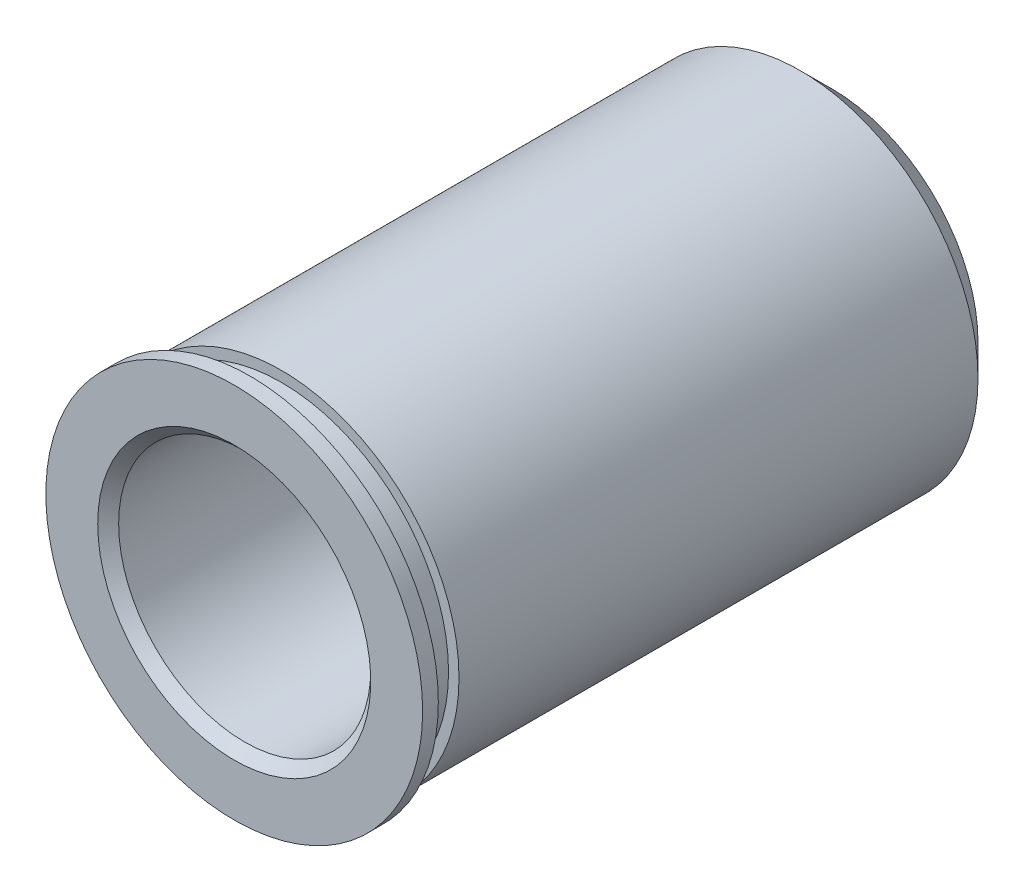
ISO-10303-21;
HEADER;
FILE_DESCRIPTION(('STEP AP214'),'2;1');
FILE_NAME('part.step','',(''),(''),'','','');
FILE_SCHEMA(('AUTOMOTIVE_DESIGN { 1 0 10303 214 1 1 1 1 }'));
ENDSEC;
DATA;
#1=APPLICATION_CONTEXT('core data for automotive mechanical design processes');
#2=APPLICATION_PROTOCOL_DEFINITION('international standard','automotive_design',2000,#1);
#3=PRODUCT_CONTEXT('',#1,'mechanical');
#4=PRODUCT('Part','Part','',(#3));
#5=PRODUCT_RELATED_PRODUCT_CATEGORY('part','',(#4));
#6=PRODUCT_DEFINITION_FORMATION('','',#4);
#7=PRODUCT_DEFINITION_CONTEXT('part definition',#1,'design');
#8=PRODUCT_DEFINITION('design','',#6,#7);
#9=PRODUCT_DEFINITION_SHAPE('','',#8);
#10=(LENGTH_UNIT() NAMED_UNIT(*) SI_UNIT(.MILLI.,.METRE.));
#11=(NAMED_UNIT(*) PLANE_ANGLE_UNIT() SI_UNIT($,.RADIAN.));
#12=(NAMED_UNIT(*) SI_UNIT($,.STERADIAN.) SOLID_ANGLE_UNIT());
#13=UNCERTAINTY_MEASURE_WITH_UNIT(LENGTH_MEASURE(1.E-05),#10,'distance_accuracy_value','');
#14=(GEOMETRIC_REPRESENTATION_CONTEXT(3) GLOBAL_UNCERTAINTY_ASSIGNED_CONTEXT((#13)) GLOBAL_UNIT_ASSIGNED_CONTEXT((#10,
#11,#12)) REPRESENTATION_CONTEXT('',''));
#15=CARTESIAN_POINT('',(0.,0.,0.));
#16=DIRECTION('',(0.,0.,1.));
#17=DIRECTION('',(1.,0.,0.));
#18=AXIS2_PLACEMENT_3D('',#15,#16,#17);
#19=CARTESIAN_POINT('',(0.,3.059,7.25));
#20=DIRECTION('',(0.,0.,-1.));
#21=DIRECTION('',(-1.,0.,0.));
#22=AXIS2_PLACEMENT_3D('',#19,#20,#21);
#23=PLANE('',#22);
#24=CARTESIAN_POINT('',(0.,0.,7.25));
#25=DIRECTION('',(0.,0.,-1.));
#26=DIRECTION('',(-1.,0.,0.));
#27=AXIS2_PLACEMENT_3D('',#24,#25,#26);
#28=CIRCLE('',#27,3.313);
#29=CARTESIAN_POINT('',(-3.313,0.,7.25));
#30=VERTEX_POINT('',#29);
#31=EDGE_CURVE('E9',#30,#30,#28,.T.);
#32=ORIENTED_EDGE('',*,*,#31,.T.);
#33=EDGE_LOOP('',(#32));
#34=FACE_BOUND('',#33,.T.);
#35=CARTESIAN_POINT('',(0.,0.,7.25));
#36=DIRECTION('',(0.,0.,1.));
#37=DIRECTION('',(1.,0.,0.));
#38=AXIS2_PLACEMENT_3D('',#35,#36,#37);
#39=CIRCLE('',#38,4.572);
#40=CARTESIAN_POINT('',(4.572,0.,7.25));
#41=VERTEX_POINT('',#40);
#42=EDGE_CURVE('E51',#41,#41,#39,.T.);
#43=ORIENTED_EDGE('',*,*,#42,.T.);
#44=EDGE_LOOP('',(#43));
#45=FACE_BOUND('',#44,.T.);
#46=ADVANCED_FACE('F13',(#34,#45),#23,.F.);
#47=CARTESIAN_POINT('',(0.,0.,7.25));
#48=DIRECTION('',(0.,0.,1.));
#49=DIRECTION('',(1.,0.,0.));
#50=AXIS2_PLACEMENT_3D('',#47,#48,#49);
#51=CYLINDRICAL_SURFACE('',#50,3.059);
#52=CARTESIAN_POINT('',(0.,0.,-6.996));
#53=DIRECTION('',(0.,0.,1.));
#54=DIRECTION('',(1.,0.,0.));
#55=AXIS2_PLACEMENT_3D('',#52,#53,#54);
#56=CIRCLE('',#55,3.059);
#57=CARTESIAN_POINT('',(3.059,0.,-6.996));
#58=VERTEX_POINT('',#57);
#59=EDGE_CURVE('E20',#58,#58,#56,.F.);
#60=ORIENTED_EDGE('',*,*,#59,.T.);
#61=EDGE_LOOP('',(#60));
#62=FACE_BOUND('',#61,.T.);
#63=CARTESIAN_POINT('',(0.,0.,6.996));
#64=DIRECTION('',(0.,0.,-1.));
#65=DIRECTION('',(-1.,0.,0.));
#66=AXIS2_PLACEMENT_3D('',#63,#64,#65);
#67=CIRCLE('',#66,3.059);
#68=CARTESIAN_POINT('',(-3.059,0.,6.996));
#69=VERTEX_POINT('',#68);
#70=EDGE_CURVE('E24',#69,#69,#67,.F.);
#71=ORIENTED_EDGE('',*,*,#70,.T.);
#72=EDGE_LOOP('',(#71));
#73=FACE_BOUND('',#72,.T.);
#74=ADVANCED_FACE('F90',(#62,#73),#51,.F.);
#75=CARTESIAN_POINT('',(0.,3.059,-7.25));
#76=DIRECTION('',(0.,0.,1.));
#77=DIRECTION('',(1.,0.,0.));
#78=AXIS2_PLACEMENT_3D('',#75,#76,#77);
#79=PLANE('',#78);
#80=CARTESIAN_POINT('',(0.,0.,-7.25));
#81=DIRECTION('',(0.,0.,1.));
#82=DIRECTION('',(1.,0.,0.));
#83=AXIS2_PLACEMENT_3D('',#80,#81,#82);
#84=CIRCLE('',#83,3.313);
#85=CARTESIAN_POINT('',(3.313,0.,-7.25));
#86=VERTEX_POINT('',#85);
#87=EDGE_CURVE('E28',#86,#86,#84,.T.);
#88=ORIENTED_EDGE('',*,*,#87,.T.);
#89=EDGE_LOOP('',(#88));
#90=FACE_BOUND('',#89,.T.);
#91=CARTESIAN_POINT('',(0.,0.,-7.25));
#92=DIRECTION('',(0.,0.,1.));
#93=DIRECTION('',(1.,0.,0.));
#94=AXIS2_PLACEMENT_3D('',#91,#92,#93);
#95=CIRCLE('',#94,3.54965);
#96=CARTESIAN_POINT('',(3.54965,0.,-7.25));
#97=VERTEX_POINT('',#96);
#98=EDGE_CURVE('E33',#97,#97,#95,.F.);
#99=ORIENTED_EDGE('',*,*,#98,.T.);
#100=EDGE_LOOP('',(#99));
#101=FACE_BOUND('',#100,.T.);
#102=ADVANCED_FACE('F83',(#90,#101),#79,.F.);
#103=CARTESIAN_POINT('',(0.,0.,7.25));
#104=DIRECTION('',(0.,0.,1.));
#105=DIRECTION('',(1.,0.,0.));
#106=AXIS2_PLACEMENT_3D('',#103,#104,#105);
#107=CYLINDRICAL_SURFACE('',#106,4.31165);
#108=CARTESIAN_POINT('',(0.,0.,-6.488));
#109=DIRECTION('',(0.,0.,1.));
#110=DIRECTION('',(1.,0.,0.));
#111=AXIS2_PLACEMENT_3D('',#108,#109,#110);
#112=CIRCLE('',#111,4.31165);
#113=CARTESIAN_POINT('',(4.31165,0.,-6.488));
#114=VERTEX_POINT('',#113);
#115=EDGE_CURVE('E36',#114,#114,#112,.T.);
#116=ORIENTED_EDGE('',*,*,#115,.T.);
#117=EDGE_LOOP('',(#116));
#118=FACE_BOUND('',#117,.T.);
#119=CARTESIAN_POINT('',(0.,0.,6.107));
#120=DIRECTION('',(0.,0.,1.));
#121=DIRECTION('',(1.,0.,0.));
#122=AXIS2_PLACEMENT_3D('',#119,#120,#121);
#123=CIRCLE('',#122,4.31165);
#124=CARTESIAN_POINT('',(4.31165,0.,6.107));
#125=VERTEX_POINT('',#124);
#126=EDGE_CURVE('E39',#125,#125,#123,.T.);
#127=ORIENTED_EDGE('',*,*,#126,.F.);
#128=EDGE_LOOP('',(#127));
#129=FACE_BOUND('',#128,.T.);
#130=ADVANCED_FACE('F78',(#118,#129),#107,.T.);
#131=CARTESIAN_POINT('',(0.,4.31165,6.107));
#132=DIRECTION('',(0.,0.,-1.));
#133=DIRECTION('',(-1.,0.,0.));
#134=AXIS2_PLACEMENT_3D('',#131,#132,#133);
#135=PLANE('',#134);
#136=CARTESIAN_POINT('',(0.,0.,6.107));
#137=DIRECTION('',(0.,0.,1.));
#138=DIRECTION('',(1.,0.,0.));
#139=AXIS2_PLACEMENT_3D('',#136,#137,#138);
#140=CIRCLE('',#139,4.05765);
#141=CARTESIAN_POINT('',(4.05765,0.,6.107));
#142=VERTEX_POINT('',#141);
#143=EDGE_CURVE('E42',#142,#142,#140,.T.);
#144=ORIENTED_EDGE('',*,*,#143,.F.);
#145=EDGE_LOOP('',(#144));
#146=FACE_BOUND('',#145,.T.);
#147=ORIENTED_EDGE('',*,*,#126,.T.);
#148=EDGE_LOOP('',(#147));
#149=FACE_BOUND('',#148,.T.);
#150=ADVANCED_FACE('F72',(#146,#149),#135,.F.);
#151=CARTESIAN_POINT('',(0.,0.,7.25));
#152=DIRECTION('',(0.,0.,1.));
#153=DIRECTION('',(1.,0.,0.));
#154=AXIS2_PLACEMENT_3D('',#151,#152,#153);
#155=CYLINDRICAL_SURFACE('',#154,4.05765);
#156=CARTESIAN_POINT('',(0.,0.,6.869));
#157=DIRECTION('',(0.,0.,1.));
#158=DIRECTION('',(1.,0.,0.));
#159=AXIS2_PLACEMENT_3D('',#156,#157,#158);
#160=CIRCLE('',#159,4.05765);
#161=CARTESIAN_POINT('',(4.05765,0.,6.869));
#162=VERTEX_POINT('',#161);
#163=EDGE_CURVE('E45',#162,#162,#160,.T.);
#164=ORIENTED_EDGE('',*,*,#163,.F.);
#165=EDGE_LOOP('',(#164));
#166=FACE_BOUND('',#165,.T.);
#167=ORIENTED_EDGE('',*,*,#143,.T.);
#168=EDGE_LOOP('',(#167));
#169=FACE_BOUND('',#168,.T.);
#170=ADVANCED_FACE('F66',(#166,#169),#155,.T.);
#171=CARTESIAN_POINT('',(0.,4.05765,6.869));
#172=DIRECTION('',(0.,0.,1.));
#173=DIRECTION('',(1.,0.,0.));
#174=AXIS2_PLACEMENT_3D('',#171,#172,#173);
#175=PLANE('',#174);
#176=CARTESIAN_POINT('',(0.,0.,6.869));
#177=DIRECTION('',(0.,0.,1.));
#178=DIRECTION('',(1.,0.,0.));
#179=AXIS2_PLACEMENT_3D('',#176,#177,#178);
#180=CIRCLE('',#179,4.572);
#181=CARTESIAN_POINT('',(4.572,0.,6.869));
#182=VERTEX_POINT('',#181);
#183=EDGE_CURVE('E48',#182,#182,#180,.T.);
#184=ORIENTED_EDGE('',*,*,#183,.F.);
#185=EDGE_LOOP('',(#184));
#186=FACE_BOUND('',#185,.T.);
#187=ORIENTED_EDGE('',*,*,#163,.T.);
#188=EDGE_LOOP('',(#187));
#189=FACE_BOUND('',#188,.T.);
#190=ADVANCED_FACE('F60',(#186,#189),#175,.F.);
#191=CARTESIAN_POINT('',(0.,0.,7.25));
#192=DIRECTION('',(0.,0.,1.));
#193=DIRECTION('',(1.,0.,0.));
#194=AXIS2_PLACEMENT_3D('',#191,#192,#193);
#195=CYLINDRICAL_SURFACE('',#194,4.572);
#196=ORIENTED_EDGE('',*,*,#42,.F.);
#197=EDGE_LOOP('',(#196));
#198=FACE_BOUND('',#197,.T.);
#199=ORIENTED_EDGE('',*,*,#183,.T.);
#200=EDGE_LOOP('',(#199));
#201=FACE_BOUND('',#200,.T.);
#202=ADVANCED_FACE('F56',(#198,#201),#195,.T.);
#203=CARTESIAN_POINT('',(0.,0.,-6.488));
#204=DIRECTION('',(0.,0.,1.));
#205=DIRECTION('',(1.,0.,0.));
#206=AXIS2_PLACEMENT_3D('',#203,#204,#205);
#207=CONICAL_SURFACE('',#206,4.31165,0.785398163397449);
#208=ORIENTED_EDGE('',*,*,#98,.F.);
#209=EDGE_LOOP('',(#208));
#210=FACE_BOUND('',#209,.T.);
#211=ORIENTED_EDGE('',*,*,#115,.F.);
#212=EDGE_LOOP('',(#211));
#213=FACE_BOUND('',#212,.T.);
#214=ADVANCED_FACE('F59',(#210,#213),#207,.T.);
#215=CARTESIAN_POINT('',(0.,0.,-7.25));
#216=DIRECTION('',(0.,0.,-1.));
#217=DIRECTION('',(-1.,0.,0.));
#218=AXIS2_PLACEMENT_3D('',#215,#216,#217);
#219=CONICAL_SURFACE('',#218,3.313,0.785398163397447);
#220=ORIENTED_EDGE('',*,*,#59,.F.);
#221=EDGE_LOOP('',(#220));
#222=FACE_BOUND('',#221,.T.);
#223=ORIENTED_EDGE('',*,*,#87,.F.);
#224=EDGE_LOOP('',(#223));
#225=FACE_BOUND('',#224,.T.);
#226=ADVANCED_FACE('F101',(#222,#225),#219,.F.);
#227=CARTESIAN_POINT('',(0.,0.,6.996));
#228=DIRECTION('',(0.,0.,1.));
#229=DIRECTION('',(1.,0.,0.));
#230=AXIS2_PLACEMENT_3D('',#227,#228,#229);
#231=CONICAL_SURFACE('',#230,3.059,0.785398163397452);
#232=ORIENTED_EDGE('',*,*,#31,.F.);
#233=EDGE_LOOP('',(#232));
#234=FACE_BOUND('',#233,.T.);
#235=ORIENTED_EDGE('',*,*,#70,.F.);
#236=EDGE_LOOP('',(#235));
#237=FACE_BOUND('',#236,.T.);
#238=ADVANCED_FACE('F15',(#234,#237),#231,.F.);
#239=CLOSED_SHELL('',(#46,#74,#102,#130,#150,#170,#190,#202,#214,#226,#238));
#240=MANIFOLD_SOLID_BREP('B1',#239);
#241=ADVANCED_BREP_SHAPE_REPRESENTATION('',(#18,#240),#14);
#242=SHAPE_DEFINITION_REPRESENTATION(#9,#241);
ENDSEC;
END-ISO-10303-21;
